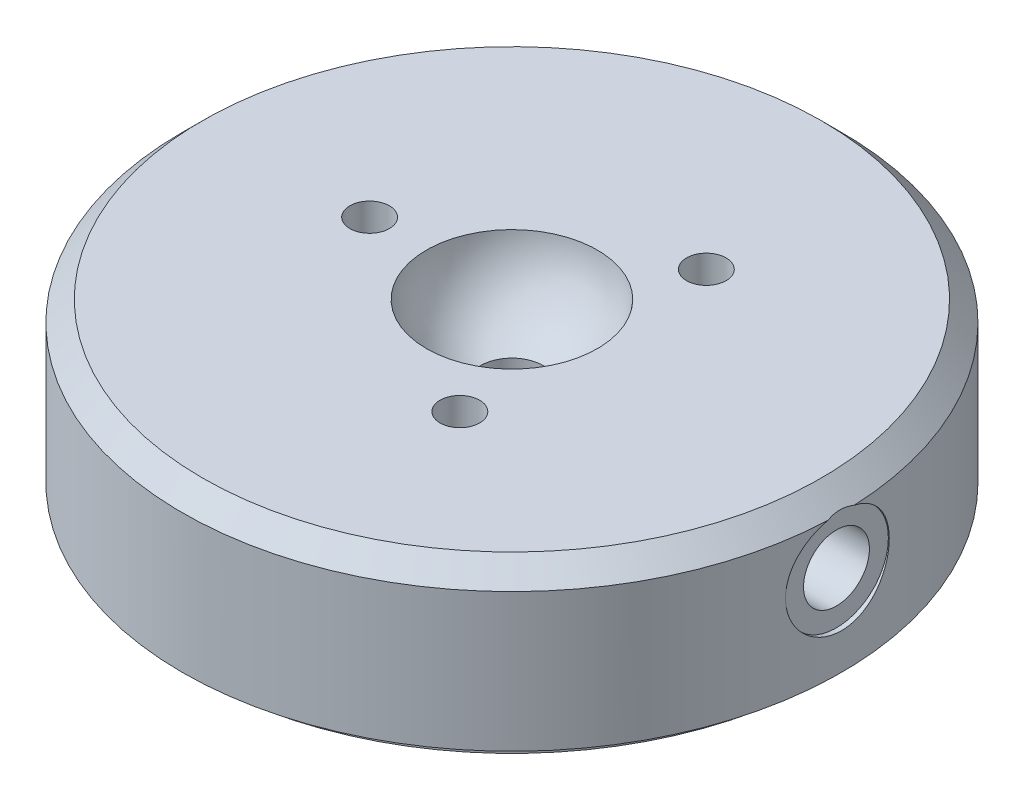
ISO-10303-21;
HEADER;
FILE_DESCRIPTION(('STEP AP214'),'2;1');
FILE_NAME('part.step','',(''),(''),'','','');
FILE_SCHEMA(('AUTOMOTIVE_DESIGN { 1 0 10303 214 1 1 1 1 }'));
ENDSEC;
DATA;
#1=APPLICATION_CONTEXT('core data for automotive mechanical design processes');
#2=APPLICATION_PROTOCOL_DEFINITION('international standard','automotive_design',2000,#1);
#3=PRODUCT_CONTEXT('',#1,'mechanical');
#4=PRODUCT('Part','Part','',(#3));
#5=PRODUCT_RELATED_PRODUCT_CATEGORY('part','',(#4));
#6=PRODUCT_DEFINITION_FORMATION('','',#4);
#7=PRODUCT_DEFINITION_CONTEXT('part definition',#1,'design');
#8=PRODUCT_DEFINITION('design','',#6,#7);
#9=PRODUCT_DEFINITION_SHAPE('','',#8);
#10=(LENGTH_UNIT() NAMED_UNIT(*) SI_UNIT(.MILLI.,.METRE.));
#11=(NAMED_UNIT(*) PLANE_ANGLE_UNIT() SI_UNIT($,.RADIAN.));
#12=(NAMED_UNIT(*) SI_UNIT($,.STERADIAN.) SOLID_ANGLE_UNIT());
#13=UNCERTAINTY_MEASURE_WITH_UNIT(LENGTH_MEASURE(1.E-05),#10,'distance_accuracy_value','');
#14=(GEOMETRIC_REPRESENTATION_CONTEXT(3) GLOBAL_UNCERTAINTY_ASSIGNED_CONTEXT((#13)) GLOBAL_UNIT_ASSIGNED_CONTEXT((#10,
#11,#12)) REPRESENTATION_CONTEXT('',''));
#15=CARTESIAN_POINT('',(0.,0.,0.));
#16=DIRECTION('',(0.,0.,1.));
#17=DIRECTION('',(1.,0.,0.));
#18=AXIS2_PLACEMENT_3D('',#15,#16,#17);
#19=CARTESIAN_POINT('',(0.,0.,0.));
#20=DIRECTION('',(0.,1.,0.));
#21=DIRECTION('',(0.,0.,1.));
#22=AXIS2_PLACEMENT_3D('',#19,#20,#21);
#23=PLANE('',#22);
#24=CARTESIAN_POINT('',(0.,0.,0.));
#25=DIRECTION('',(0.,1.,0.));
#26=DIRECTION('',(0.,0.,1.));
#27=AXIS2_PLACEMENT_3D('',#24,#25,#26);
#28=CIRCLE('',#27,25.);
#29=CARTESIAN_POINT('',(0.,0.,25.));
#30=VERTEX_POINT('',#29);
#31=EDGE_CURVE('E98',#30,#30,#28,.T.);
#32=ORIENTED_EDGE('',*,*,#31,.F.);
#33=EDGE_LOOP('',(#32));
#34=FACE_BOUND('',#33,.T.);
#35=CARTESIAN_POINT('',(0.,0.,0.));
#36=DIRECTION('',(0.,1.,0.));
#37=DIRECTION('',(0.,0.,1.));
#38=AXIS2_PLACEMENT_3D('',#35,#36,#37);
#39=CIRCLE('',#38,23.8062);
#40=CARTESIAN_POINT('',(0.,0.,23.8062));
#41=VERTEX_POINT('',#40);
#42=EDGE_CURVE('E61',#41,#41,#39,.F.);
#43=ORIENTED_EDGE('',*,*,#42,.F.);
#44=EDGE_LOOP('',(#43));
#45=FACE_BOUND('',#44,.T.);
#46=ADVANCED_FACE('F48',(#34,#45),#23,.F.);
#47=CARTESIAN_POINT('',(0.,12.0142,0.));
#48=DIRECTION('',(0.,-1.,0.));
#49=DIRECTION('',(0.,0.,-1.));
#50=AXIS2_PLACEMENT_3D('',#47,#48,#49);
#51=CYLINDRICAL_SURFACE('',#50,25.);
#52=CARTESIAN_POINT('',(0.,10.4902,0.));
#53=DIRECTION('',(0.,1.,0.));
#54=DIRECTION('',(0.,0.,1.));
#55=AXIS2_PLACEMENT_3D('',#52,#53,#54);
#56=CIRCLE('',#55,25.);
#57=CARTESIAN_POINT('',(24.9803148699131,10.4902,0.991901708840162));
#58=VERTEX_POINT('',#57);
#59=CARTESIAN_POINT('',(24.9803148699131,10.4902,-0.991901708840163));
#60=VERTEX_POINT('',#59);
#61=EDGE_CURVE('E86',#58,#60,#56,.F.);
#62=ORIENTED_EDGE('',*,*,#61,.T.);
#63=CARTESIAN_POINT('',(24.9803148699131,10.4902,-0.991901708840163));
#64=CARTESIAN_POINT('',(24.9760644121017,10.4623048694706,-1.09909263906591));
#65=CARTESIAN_POINT('',(24.9711596439136,10.4298739163801,-1.20506872251176));
#66=CARTESIAN_POINT('',(24.9602057760031,10.3562333686283,-1.41385230001184));
#67=CARTESIAN_POINT('',(24.9541568017236,10.3150247362288,-1.51666013997494));
#68=CARTESIAN_POINT('',(24.9410841497244,10.224159676023,-1.71829432237623));
#69=CARTESIAN_POINT('',(24.9340614229706,10.174511479727,-1.81712442941466));
#70=CARTESIAN_POINT('',(24.9192396242253,10.0671312351788,-2.0101950893509));
#71=CARTESIAN_POINT('',(24.9114405484112,10.009399147123,-2.10443561964742));
#72=CARTESIAN_POINT('',(24.8871967636647,9.82463062969311,-2.3793201898814));
#73=CARTESIAN_POINT('',(24.8698958404626,9.68595784311372,-2.55226903288885));
#74=CARTESIAN_POINT('',(24.8349644259187,9.38171910014679,-2.87238449379057));
#75=CARTESIAN_POINT('',(24.8173339539457,9.21615471989303,-3.01955262165919));
#76=CARTESIAN_POINT('',(24.7836125106737,8.86163506745147,-3.28489903018674));
#77=CARTESIAN_POINT('',(24.7675303397823,8.67255864957774,-3.40291695157319));
#78=CARTESIAN_POINT('',(24.7388545000623,8.2769938819654,-3.605496571226));
#79=CARTESIAN_POINT('',(24.7262610838239,8.07050427290122,-3.69005584723468));
#80=CARTESIAN_POINT('',(24.7060853872872,7.64717285774298,-3.82280792954634));
#81=CARTESIAN_POINT('',(24.698475589149,7.4303951106718,-3.87120064834859));
#82=CARTESIAN_POINT('',(24.6890460131689,6.99168557490381,-3.93089587270417));
#83=CARTESIAN_POINT('',(24.6872255081698,6.76975443701992,-3.94220303634909));
#84=CARTESIAN_POINT('',(24.6895735821576,6.32955241819738,-3.92746734125161));
#85=CARTESIAN_POINT('',(24.6936784051449,6.11126775975518,-3.90182209248306));
#86=CARTESIAN_POINT('',(24.7072887255053,5.68215127251021,-3.814682728154));
#87=CARTESIAN_POINT('',(24.716794367963,5.47131964408339,-3.75318764954117));
#88=CARTESIAN_POINT('',(24.7401360066554,5.06280397052349,-3.59610060480126));
#89=CARTESIAN_POINT('',(24.753976134313,4.86513268808484,-3.50047609594989));
#90=CARTESIAN_POINT('',(24.7844326557749,4.48854528250317,-3.27787581141221));
#91=CARTESIAN_POINT('',(24.8010492349438,4.30963041289519,-3.15089794220778));
#92=CARTESIAN_POINT('',(24.8354151853885,3.97351829245995,-2.8675238704803));
#93=CARTESIAN_POINT('',(24.8531750832332,3.81658414811986,-2.71081677269578));
#94=CARTESIAN_POINT('',(24.8876763015987,3.53114818508684,-2.37324690991153));
#95=CARTESIAN_POINT('',(24.9044175918141,3.40264721202763,-2.19238342673084));
#96=CARTESIAN_POINT('',(24.9350775441802,3.17725487143786,-1.81070597410455));
#97=CARTESIAN_POINT('',(24.9489845691253,3.08049286854182,-1.60981460336029));
#98=CARTESIAN_POINT('',(24.9723191119489,2.92216038382323,-1.1943677727902));
#99=CARTESIAN_POINT('',(24.9817469233442,2.8605875960449,-0.979813209340219));
#100=CARTESIAN_POINT('',(24.9949907062918,2.77490593618166,-0.545211430466069));
#101=CARTESIAN_POINT('',(24.9988569619274,2.75046126096289,-0.325231960355635));
#102=CARTESIAN_POINT('',(25.0007041424915,2.73872621275646,0.11573406862397));
#103=CARTESIAN_POINT('',(24.9986853762922,2.75143388984804,0.336720574031653));
#104=CARTESIAN_POINT('',(24.9890298596355,2.81335510775831,0.771579066882193));
#105=CARTESIAN_POINT('',(24.9814380309596,2.86227677131175,0.985493731347864));
#106=CARTESIAN_POINT('',(24.9615257732719,2.9948233185039,1.40205029090125));
#107=CARTESIAN_POINT('',(24.9492051815791,3.07844939606734,1.60469179789016));
#108=CARTESIAN_POINT('',(24.9211080130636,3.27852187470918,1.99417794500723));
#109=CARTESIAN_POINT('',(24.9053132782849,3.39514167340364,2.18093215784569));
#110=CARTESIAN_POINT('',(24.8720405347276,3.65773673705456,2.53235198365155));
#111=CARTESIAN_POINT('',(24.8545624044904,3.80371412101707,2.69701600073595));
#112=CARTESIAN_POINT('',(24.8196576709345,4.1227170095977,3.00139286443896));
#113=CARTESIAN_POINT('',(24.8022335602207,4.29601183151788,3.1408239028407));
#114=CARTESIAN_POINT('',(24.7695929059416,4.6637228605155,3.38864934140278));
#115=CARTESIAN_POINT('',(24.7543763528057,4.8581389760177,3.49704387612014));
#116=CARTESIAN_POINT('',(24.7278999953282,5.26257760548963,3.67960766646352));
#117=CARTESIAN_POINT('',(24.7166383011144,5.47259260707547,3.7537932745173));
#118=CARTESIAN_POINT('',(24.6993743084843,5.90231548178541,3.86576694062713));
#119=CARTESIAN_POINT('',(24.6933715957342,6.12202258987482,3.90355786609635));
#120=CARTESIAN_POINT('',(24.6873655534825,6.56229797704927,3.9413639640254));
#121=CARTESIAN_POINT('',(24.6872968177525,6.78283006332407,3.94179097444437));
#122=CARTESIAN_POINT('',(24.6930015917386,7.22080155281397,3.90589206503232));
#123=CARTESIAN_POINT('',(24.6987750116465,7.43824100351832,3.86956671017495));
#124=CARTESIAN_POINT('',(24.7154607258084,7.86292430484263,3.76150836552324));
#125=CARTESIAN_POINT('',(24.7263510250776,8.07020764047359,3.68992686187712));
#126=CARTESIAN_POINT('',(24.7520308367825,8.46983818355237,3.51352567382607));
#127=CARTESIAN_POINT('',(24.7668202464704,8.66218578440777,3.40870686526246));
#128=CARTESIAN_POINT('',(24.7987966108039,9.0283705778677,3.16773793796091));
#129=CARTESIAN_POINT('',(24.8160038716045,9.20202635713444,3.03131534729049));
#130=CARTESIAN_POINT('',(24.8508146379017,9.52426004834777,2.73124823369439));
#131=CARTESIAN_POINT('',(24.868418346291,9.67282477279947,2.56758948499511));
#132=CARTESIAN_POINT('',(24.8937152075362,9.87418284690543,2.30452838637883));
#133=CARTESIAN_POINT('',(24.9020018023323,9.9379882280999,2.21340574372853));
#134=CARTESIAN_POINT('',(24.9179431995995,10.057680869463,2.02606120620131));
#135=CARTESIAN_POINT('',(24.9255982430182,10.1135711552612,1.92984127924753));
#136=CARTESIAN_POINT('',(24.9400470316092,10.2169403600693,1.73313858266539));
#137=CARTESIAN_POINT('',(24.9468421684136,10.2644329203657,1.63266306120472));
#138=CARTESIAN_POINT('',(24.9593906463261,10.350755136961,1.42804376194001));
#139=CARTESIAN_POINT('',(24.9651446256143,10.3895901033647,1.32390227828425));
#140=CARTESIAN_POINT('',(24.9721219509041,10.4361268702976,1.18090322275723));
#141=CARTESIAN_POINT('',(24.9738717483264,10.4477400793774,1.14331091754036));
#142=CARTESIAN_POINT('',(24.9772128267798,10.4698238217765,1.06783127047912));
#143=CARTESIAN_POINT('',(24.9788042843043,10.4802956286319,1.02994430905506));
#144=CARTESIAN_POINT('',(24.9803148699131,10.4902,0.991901708840163));
#145=B_SPLINE_CURVE_WITH_KNOTS('',3,(#63,#64,#65,#66,#67,#68,#69,#70,#71,#72,#73,#74,#75,#76,
#77,#78,#79,#80,#81,#82,#83,#84,#85,#86,#87,#88,#89,#90,#91,#92,#93,#94,#95,#96,#97,#98,#99,
#100,#101,#102,#103,#104,#105,#106,#107,#108,#109,#110,#111,#112,#113,#114,#115,#116,#117,#118,
#119,#120,#121,#122,#123,#124,#125,#126,#127,#128,#129,#130,#131,#132,#133,#134,#135,#136,#137,
#138,#139,#140,#141,#142,#143,#144),.UNSPECIFIED.,.F.,.F.,(4,2,2,2,2,2,2,2,2,2,2,2,2,2,2,2,2,2,
2,2,2,2,2,2,2,2,2,2,2,2,2,2,2,2,2,2,2,2,2,2,4),(0.,0.332414110908146,0.664791799325737,
0.996847144702373,1.32890412511467,1.99255614185707,2.65616927555023,3.32335556075986,
3.99059013846687,4.65410869599637,5.31754390979323,5.97389360945856,6.63026094179411,
7.28725580577416,7.94429455030674,8.60862634351044,9.27297789201588,9.94000455805763,
10.606987508705,11.2679012752411,11.9287803547049,12.5843900975884,13.2400223970716,
13.8991664874663,14.558358171419,15.2245100286738,15.8906589978205,16.5564892059006,
17.2222669511924,17.880705329588,18.5391335863309,19.1947571155721,19.8503633698129,
20.5118473823875,21.1736779866784,21.5079962917394,21.8421864531041,22.175828665773,
22.509265673676,22.6274046365613,22.7454104049011),.UNSPECIFIED.);
#146=EDGE_CURVE('E66',#60,#58,#145,.T.);
#147=ORIENTED_EDGE('',*,*,#146,.T.);
#148=EDGE_LOOP('',(#62,#147));
#149=FACE_BOUND('',#148,.T.);
#150=ORIENTED_EDGE('',*,*,#31,.T.);
#151=EDGE_LOOP('',(#150));
#152=FACE_BOUND('',#151,.T.);
#153=ADVANCED_FACE('F83',(#149,#152),#51,.T.);
#154=CARTESIAN_POINT('',(0.,12.0142,0.));
#155=DIRECTION('',(0.,1.,0.));
#156=DIRECTION('',(0.,0.,1.));
#157=AXIS2_PLACEMENT_3D('',#154,#155,#156);
#158=PLANE('',#157);
#159=CARTESIAN_POINT('',(5.39749999999991,12.0142,9.34874423385306));
#160=DIRECTION('',(0.,1.,0.));
#161=DIRECTION('',(0.,0.,1.));
#162=AXIS2_PLACEMENT_3D('',#159,#160,#161);
#163=CIRCLE('',#162,1.5);
#164=CARTESIAN_POINT('',(5.39749999999991,12.0142,10.8487442338531));
#165=VERTEX_POINT('',#164);
#166=EDGE_CURVE('E265',#165,#165,#163,.T.);
#167=ORIENTED_EDGE('',*,*,#166,.F.);
#168=EDGE_LOOP('',(#167));
#169=FACE_BOUND('',#168,.T.);
#170=CARTESIAN_POINT('',(5.39750000000004,12.0142,-9.34874423385299));
#171=DIRECTION('',(0.,1.,0.));
#172=DIRECTION('',(0.,0.,1.));
#173=AXIS2_PLACEMENT_3D('',#170,#171,#172);
#174=CIRCLE('',#173,1.5);
#175=CARTESIAN_POINT('',(5.39750000000004,12.0142,-7.84874423385299));
#176=VERTEX_POINT('',#175);
#177=EDGE_CURVE('E253',#176,#176,#174,.T.);
#178=ORIENTED_EDGE('',*,*,#177,.F.);
#179=EDGE_LOOP('',(#178));
#180=FACE_BOUND('',#179,.T.);
#181=CARTESIAN_POINT('',(-10.795,12.0142,0.));
#182=DIRECTION('',(0.,1.,0.));
#183=DIRECTION('',(0.,0.,1.));
#184=AXIS2_PLACEMENT_3D('',#181,#182,#183);
#185=CIRCLE('',#184,1.5);
#186=CARTESIAN_POINT('',(-10.795,12.0142,1.5));
#187=VERTEX_POINT('',#186);
#188=EDGE_CURVE('E241',#187,#187,#185,.T.);
#189=ORIENTED_EDGE('',*,*,#188,.F.);
#190=EDGE_LOOP('',(#189));
#191=FACE_BOUND('',#190,.T.);
#192=CARTESIAN_POINT('',(0.,12.0142,0.));
#193=DIRECTION('',(0.,1.,0.));
#194=DIRECTION('',(0.,0.,1.));
#195=AXIS2_PLACEMENT_3D('',#192,#193,#194);
#196=CIRCLE('',#195,6.48252587808178);
#197=CARTESIAN_POINT('',(0.,12.0142,6.48252587808178));
#198=VERTEX_POINT('',#197);
#199=EDGE_CURVE('E102',#198,#198,#196,.T.);
#200=ORIENTED_EDGE('',*,*,#199,.F.);
#201=EDGE_LOOP('',(#200));
#202=FACE_BOUND('',#201,.T.);
#203=CARTESIAN_POINT('',(0.,12.0142,0.));
#204=DIRECTION('',(0.,1.,0.));
#205=DIRECTION('',(0.,0.,1.));
#206=AXIS2_PLACEMENT_3D('',#203,#204,#205);
#207=CIRCLE('',#206,23.476);
#208=CARTESIAN_POINT('',(0.,12.0142,23.476));
#209=VERTEX_POINT('',#208);
#210=EDGE_CURVE('E93',#209,#209,#207,.T.);
#211=ORIENTED_EDGE('',*,*,#210,.T.);
#212=EDGE_LOOP('',(#211));
#213=FACE_BOUND('',#212,.T.);
#214=ADVANCED_FACE('F213',(#169,#180,#191,#202,#213),#158,.T.);
#215=CARTESIAN_POINT('',(0.,12.0142,0.));
#216=DIRECTION('',(0.,-1.,0.));
#217=DIRECTION('',(0.,0.,-1.));
#218=AXIS2_PLACEMENT_3D('',#215,#216,#217);
#219=CONICAL_SURFACE('',#218,23.476,0.785398163397444);
#220=CARTESIAN_POINT('',(24.9912617892735,10.4773,-1.04019257351706));
#221=CARTESIAN_POINT('',(24.9720594670814,10.4999216717859,-0.957673295653899));
#222=CARTESIAN_POINT('',(24.9550859961547,10.5199599164967,-0.87391189493616));
#223=CARTESIAN_POINT('',(24.9257659228492,10.5546222020788,-0.704463924926277));
#224=CARTESIAN_POINT('',(24.9134202948386,10.5692451027699,-0.618776954236183));
#225=CARTESIAN_POINT('',(24.8938197103978,10.5924801009405,-0.448559412427655));
#226=CARTESIAN_POINT('',(24.8864283659726,10.6012532003374,-0.364066623537885));
#227=CARTESIAN_POINT('',(24.8762693044207,10.613315207545,-0.194426546820808));
#228=CARTESIAN_POINT('',(24.8735008887704,10.6166049438905,-0.109279359826524));
#229=CARTESIAN_POINT('',(24.8726032521123,10.6176713308341,0.0649686387439396));
#230=CARTESIAN_POINT('',(24.8746917628012,10.615189235687,0.154072349882698));
#231=CARTESIAN_POINT('',(24.8839338928822,10.6042143304783,0.331663122382244));
#232=CARTESIAN_POINT('',(24.8910887166382,10.5957200912099,0.420150032065106));
#233=CARTESIAN_POINT('',(24.9106668768206,10.5725069647133,0.598535207098015));
#234=CARTESIAN_POINT('',(24.9232467235405,10.5576032029229,0.688392136018941));
#235=CARTESIAN_POINT('',(24.953490648808,10.5218436782478,0.866018114178867));
#236=CARTESIAN_POINT('',(24.9711533156987,10.5009895679731,0.953787735810388));
#237=CARTESIAN_POINT('',(24.9912617892735,10.4773,1.04019257351706));
#238=B_SPLINE_CURVE_WITH_KNOTS('',3,(#220,#221,#222,#223,#224,#225,#226,#227,#228,#229,#230,
#231,#232,#233,#234,#235,#236,#237),.UNSPECIFIED.,.F.,.F.,(4,2,2,2,2,2,2,2,4),(0.,
0.263024143296641,0.526103633893643,0.78160543731945,1.0370686309806,1.30420329124433,
1.57140147608863,1.84688624853985,2.12229458404324),.UNSPECIFIED.);
#239=EDGE_CURVE('E13',#60,#58,#238,.T.);
#240=ORIENTED_EDGE('',*,*,#239,.F.);
#241=ORIENTED_EDGE('',*,*,#61,.F.);
#242=EDGE_LOOP('',(#240,#241));
#243=FACE_BOUND('',#242,.T.);
#244=ORIENTED_EDGE('',*,*,#210,.F.);
#245=EDGE_LOOP('',(#244));
#246=FACE_BOUND('',#245,.T.);
#247=ADVANCED_FACE('F50',(#243,#246),#219,.T.);
#248=CARTESIAN_POINT('',(0.,12.5222,0.));
#249=DIRECTION('',(0.,1.,0.));
#250=DIRECTION('',(1.,0.,0.));
#251=AXIS2_PLACEMENT_3D('',#248,#249,#250);
#252=SPHERICAL_SURFACE('',#251,6.5024);
#253=CARTESIAN_POINT('',(0.,6.47150960984616,0.));
#254=DIRECTION('',(0.,1.,0.));
#255=DIRECTION('',(0.,0.,1.));
#256=AXIS2_PLACEMENT_3D('',#253,#254,#255);
#257=CIRCLE('',#256,2.38124999999999);
#258=CARTESIAN_POINT('',(0.,6.47150960984616,2.38124999999999));
#259=VERTEX_POINT('',#258);
#260=EDGE_CURVE('E105',#259,#259,#257,.F.);
#261=ORIENTED_EDGE('',*,*,#260,.T.);
#262=EDGE_LOOP('',(#261));
#263=FACE_BOUND('',#262,.T.);
#264=ORIENTED_EDGE('',*,*,#199,.T.);
#265=EDGE_LOOP('',(#264));
#266=FACE_BOUND('',#265,.T.);
#267=ADVANCED_FACE('F205',(#263,#266),#252,.F.);
#268=CARTESIAN_POINT('',(0.,12.0142,0.));
#269=DIRECTION('',(0.,1.,0.));
#270=DIRECTION('',(0.,0.,1.));
#271=AXIS2_PLACEMENT_3D('',#268,#269,#270);
#272=CYLINDRICAL_SURFACE('',#271,2.38124999999999);
#273=CARTESIAN_POINT('',(0.,5.7658,0.));
#274=DIRECTION('',(0.,1.,0.));
#275=DIRECTION('',(0.,0.,1.));
#276=AXIS2_PLACEMENT_3D('',#273,#274,#275);
#277=CIRCLE('',#276,2.38125);
#278=CARTESIAN_POINT('',(0.,5.7658,2.38125));
#279=VERTEX_POINT('',#278);
#280=EDGE_CURVE('E107',#279,#279,#277,.T.);
#281=ORIENTED_EDGE('',*,*,#280,.F.);
#282=EDGE_LOOP('',(#281));
#283=FACE_BOUND('',#282,.T.);
#284=ORIENTED_EDGE('',*,*,#260,.F.);
#285=EDGE_LOOP('',(#284));
#286=FACE_BOUND('',#285,.T.);
#287=ADVANCED_FACE('F202',(#283,#286),#272,.F.);
#288=CARTESIAN_POINT('',(0.,5.7658,0.));
#289=DIRECTION('',(0.,-1.,0.));
#290=DIRECTION('',(0.,0.,-1.));
#291=AXIS2_PLACEMENT_3D('',#288,#289,#290);
#292=PLANE('',#291);
#293=ORIENTED_EDGE('',*,*,#280,.T.);
#294=EDGE_LOOP('',(#293));
#295=FACE_BOUND('',#294,.T.);
#296=ADVANCED_FACE('F200',(#295),#292,.F.);
#297=CARTESIAN_POINT('',(0.,-0.98552,0.));
#298=DIRECTION('',(0.,1.,0.));
#299=DIRECTION('',(0.,0.,1.));
#300=AXIS2_PLACEMENT_3D('',#297,#298,#299);
#301=CYLINDRICAL_SURFACE('',#300,23.8062);
#302=CARTESIAN_POINT('',(0.,-0.98552,0.));
#303=DIRECTION('',(0.,-1.,0.));
#304=DIRECTION('',(0.,0.,-1.));
#305=AXIS2_PLACEMENT_3D('',#302,#303,#304);
#306=CIRCLE('',#305,23.8062);
#307=CARTESIAN_POINT('',(0.,-0.98552,-23.8062));
#308=VERTEX_POINT('',#307);
#309=EDGE_CURVE('E229',#308,#308,#306,.T.);
#310=ORIENTED_EDGE('',*,*,#309,.F.);
#311=EDGE_LOOP('',(#310));
#312=FACE_BOUND('',#311,.T.);
#313=ORIENTED_EDGE('',*,*,#42,.T.);
#314=EDGE_LOOP('',(#313));
#315=FACE_BOUND('',#314,.T.);
#316=ADVANCED_FACE('F196',(#312,#315),#301,.T.);
#317=CARTESIAN_POINT('',(0.,-0.98552,0.));
#318=DIRECTION('',(0.,-1.,0.));
#319=DIRECTION('',(0.,0.,-1.));
#320=AXIS2_PLACEMENT_3D('',#317,#318,#319);
#321=PLANE('',#320);
#322=ORIENTED_EDGE('',*,*,#309,.T.);
#323=EDGE_LOOP('',(#322));
#324=FACE_BOUND('',#323,.T.);
#325=ADVANCED_FACE('F177',(#324),#321,.T.);
#326=CARTESIAN_POINT('',(-10.795,12.0142,0.));
#327=DIRECTION('',(0.,1.,0.));
#328=DIRECTION('',(0.,0.,1.));
#329=AXIS2_PLACEMENT_3D('',#326,#327,#328);
#330=CYLINDRICAL_SURFACE('',#329,1.5);
#331=CARTESIAN_POINT('',(-10.795,8.7122,0.));
#332=DIRECTION('',(0.,1.,0.));
#333=DIRECTION('',(0.,0.,1.));
#334=AXIS2_PLACEMENT_3D('',#331,#332,#333);
#335=CIRCLE('',#334,1.5);
#336=CARTESIAN_POINT('',(-10.795,8.7122,1.5));
#337=VERTEX_POINT('',#336);
#338=EDGE_CURVE('E244',#337,#337,#335,.T.);
#339=ORIENTED_EDGE('',*,*,#338,.F.);
#340=EDGE_LOOP('',(#339));
#341=FACE_BOUND('',#340,.T.);
#342=ORIENTED_EDGE('',*,*,#188,.T.);
#343=EDGE_LOOP('',(#342));
#344=FACE_BOUND('',#343,.T.);
#345=ADVANCED_FACE('F173',(#341,#344),#330,.F.);
#346=CARTESIAN_POINT('',(-9.545,8.7122,0.));
#347=DIRECTION('',(0.,-1.,0.));
#348=DIRECTION('',(0.,0.,-1.));
#349=AXIS2_PLACEMENT_3D('',#346,#347,#348);
#350=PLANE('',#349);
#351=CARTESIAN_POINT('',(-10.795,8.7122,0.));
#352=DIRECTION('',(0.,1.,0.));
#353=DIRECTION('',(0.,0.,1.));
#354=AXIS2_PLACEMENT_3D('',#351,#352,#353);
#355=CIRCLE('',#354,1.25);
#356=CARTESIAN_POINT('',(-10.795,8.7122,1.25));
#357=VERTEX_POINT('',#356);
#358=EDGE_CURVE('E247',#357,#357,#355,.T.);
#359=ORIENTED_EDGE('',*,*,#358,.F.);
#360=EDGE_LOOP('',(#359));
#361=FACE_BOUND('',#360,.T.);
#362=ORIENTED_EDGE('',*,*,#338,.T.);
#363=EDGE_LOOP('',(#362));
#364=FACE_BOUND('',#363,.T.);
#365=ADVANCED_FACE('F169',(#361,#364),#350,.F.);
#366=CARTESIAN_POINT('',(-10.795,12.0142,0.));
#367=DIRECTION('',(0.,1.,0.));
#368=DIRECTION('',(0.,0.,1.));
#369=AXIS2_PLACEMENT_3D('',#366,#367,#368);
#370=CYLINDRICAL_SURFACE('',#369,1.25);
#371=CARTESIAN_POINT('',(-10.795,7.212203,0.));
#372=DIRECTION('',(0.,1.,0.));
#373=DIRECTION('',(0.,0.,1.));
#374=AXIS2_PLACEMENT_3D('',#371,#372,#373);
#375=CIRCLE('',#374,1.25);
#376=CARTESIAN_POINT('',(-10.795,7.212203,1.25));
#377=VERTEX_POINT('',#376);
#378=EDGE_CURVE('E250',#377,#377,#375,.T.);
#379=ORIENTED_EDGE('',*,*,#378,.F.);
#380=EDGE_LOOP('',(#379));
#381=FACE_BOUND('',#380,.T.);
#382=ORIENTED_EDGE('',*,*,#358,.T.);
#383=EDGE_LOOP('',(#382));
#384=FACE_BOUND('',#383,.T.);
#385=ADVANCED_FACE('F165',(#381,#384),#370,.F.);
#386=CARTESIAN_POINT('',(-10.795,7.212203,0.));
#387=DIRECTION('',(0.,1.,0.));
#388=DIRECTION('',(0.,0.,1.));
#389=AXIS2_PLACEMENT_3D('',#386,#387,#388);
#390=CONICAL_SURFACE('',#389,1.25,1.02974425867665);
#391=CARTESIAN_POINT('',(-10.795,6.46112722621555,0.));
#392=VERTEX_POINT('',#391);
#393=VERTEX_LOOP('',#392);
#394=FACE_BOUND('',#393,.T.);
#395=ORIENTED_EDGE('',*,*,#378,.T.);
#396=EDGE_LOOP('',(#395));
#397=FACE_BOUND('',#396,.T.);
#398=ADVANCED_FACE('F161',(#394,#397),#390,.F.);
#399=CARTESIAN_POINT('',(5.39750000000004,12.0142,-9.34874423385299));
#400=DIRECTION('',(0.,1.,0.));
#401=DIRECTION('',(0.,0.,1.));
#402=AXIS2_PLACEMENT_3D('',#399,#400,#401);
#403=CYLINDRICAL_SURFACE('',#402,1.5);
#404=CARTESIAN_POINT('',(5.39750000000004,8.7122,-9.34874423385299));
#405=DIRECTION('',(0.,1.,0.));
#406=DIRECTION('',(0.,0.,1.));
#407=AXIS2_PLACEMENT_3D('',#404,#405,#406);
#408=CIRCLE('',#407,1.5);
#409=CARTESIAN_POINT('',(5.39750000000004,8.7122,-7.84874423385299));
#410=VERTEX_POINT('',#409);
#411=EDGE_CURVE('E256',#410,#410,#408,.T.);
#412=ORIENTED_EDGE('',*,*,#411,.F.);
#413=EDGE_LOOP('',(#412));
#414=FACE_BOUND('',#413,.T.);
#415=ORIENTED_EDGE('',*,*,#177,.T.);
#416=EDGE_LOOP('',(#415));
#417=FACE_BOUND('',#416,.T.);
#418=ADVANCED_FACE('F157',(#414,#417),#403,.F.);
#419=CARTESIAN_POINT('',(6.64750000000004,8.7122,-9.34874423385299));
#420=DIRECTION('',(0.,-1.,0.));
#421=DIRECTION('',(0.,0.,-1.));
#422=AXIS2_PLACEMENT_3D('',#419,#420,#421);
#423=PLANE('',#422);
#424=CARTESIAN_POINT('',(5.39750000000004,8.7122,-9.34874423385299));
#425=DIRECTION('',(0.,1.,0.));
#426=DIRECTION('',(0.,0.,1.));
#427=AXIS2_PLACEMENT_3D('',#424,#425,#426);
#428=CIRCLE('',#427,1.25);
#429=CARTESIAN_POINT('',(5.39750000000004,8.7122,-8.09874423385299));
#430=VERTEX_POINT('',#429);
#431=EDGE_CURVE('E259',#430,#430,#428,.T.);
#432=ORIENTED_EDGE('',*,*,#431,.F.);
#433=EDGE_LOOP('',(#432));
#434=FACE_BOUND('',#433,.T.);
#435=ORIENTED_EDGE('',*,*,#411,.T.);
#436=EDGE_LOOP('',(#435));
#437=FACE_BOUND('',#436,.T.);
#438=ADVANCED_FACE('F153',(#434,#437),#423,.F.);
#439=CARTESIAN_POINT('',(5.39750000000004,12.0142,-9.34874423385299));
#440=DIRECTION('',(0.,1.,0.));
#441=DIRECTION('',(0.,0.,1.));
#442=AXIS2_PLACEMENT_3D('',#439,#440,#441);
#443=CYLINDRICAL_SURFACE('',#442,1.25);
#444=CARTESIAN_POINT('',(5.39750000000004,7.212203,-9.34874423385299));
#445=DIRECTION('',(0.,1.,0.));
#446=DIRECTION('',(0.,0.,1.));
#447=AXIS2_PLACEMENT_3D('',#444,#445,#446);
#448=CIRCLE('',#447,1.25);
#449=CARTESIAN_POINT('',(5.39750000000004,7.212203,-8.09874423385299));
#450=VERTEX_POINT('',#449);
#451=EDGE_CURVE('E262',#450,#450,#448,.T.);
#452=ORIENTED_EDGE('',*,*,#451,.F.);
#453=EDGE_LOOP('',(#452));
#454=FACE_BOUND('',#453,.T.);
#455=ORIENTED_EDGE('',*,*,#431,.T.);
#456=EDGE_LOOP('',(#455));
#457=FACE_BOUND('',#456,.T.);
#458=ADVANCED_FACE('F149',(#454,#457),#443,.F.);
#459=CARTESIAN_POINT('',(5.39750000000004,7.212203,-9.34874423385299));
#460=DIRECTION('',(0.,1.,0.));
#461=DIRECTION('',(0.,0.,1.));
#462=AXIS2_PLACEMENT_3D('',#459,#460,#461);
#463=CONICAL_SURFACE('',#462,1.25,1.02974425867665);
#464=CARTESIAN_POINT('',(5.39750000000004,6.46112722621555,-9.34874423385299));
#465=VERTEX_POINT('',#464);
#466=VERTEX_LOOP('',#465);
#467=FACE_BOUND('',#466,.T.);
#468=ORIENTED_EDGE('',*,*,#451,.T.);
#469=EDGE_LOOP('',(#468));
#470=FACE_BOUND('',#469,.T.);
#471=ADVANCED_FACE('F145',(#467,#470),#463,.F.);
#472=CARTESIAN_POINT('',(5.39749999999991,12.0142,9.34874423385306));
#473=DIRECTION('',(0.,1.,0.));
#474=DIRECTION('',(0.,0.,1.));
#475=AXIS2_PLACEMENT_3D('',#472,#473,#474);
#476=CYLINDRICAL_SURFACE('',#475,1.5);
#477=CARTESIAN_POINT('',(5.39749999999991,8.7122,9.34874423385306));
#478=DIRECTION('',(0.,1.,0.));
#479=DIRECTION('',(0.,0.,1.));
#480=AXIS2_PLACEMENT_3D('',#477,#478,#479);
#481=CIRCLE('',#480,1.5);
#482=CARTESIAN_POINT('',(5.39749999999991,8.7122,10.8487442338531));
#483=VERTEX_POINT('',#482);
#484=EDGE_CURVE('E268',#483,#483,#481,.T.);
#485=ORIENTED_EDGE('',*,*,#484,.F.);
#486=EDGE_LOOP('',(#485));
#487=FACE_BOUND('',#486,.T.);
#488=ORIENTED_EDGE('',*,*,#166,.T.);
#489=EDGE_LOOP('',(#488));
#490=FACE_BOUND('',#489,.T.);
#491=ADVANCED_FACE('F141',(#487,#490),#476,.F.);
#492=CARTESIAN_POINT('',(6.64749999999991,8.7122,9.34874423385306));
#493=DIRECTION('',(0.,-1.,0.));
#494=DIRECTION('',(0.,0.,-1.));
#495=AXIS2_PLACEMENT_3D('',#492,#493,#494);
#496=PLANE('',#495);
#497=CARTESIAN_POINT('',(5.39749999999991,8.7122,9.34874423385306));
#498=DIRECTION('',(0.,1.,0.));
#499=DIRECTION('',(0.,0.,1.));
#500=AXIS2_PLACEMENT_3D('',#497,#498,#499);
#501=CIRCLE('',#500,1.25);
#502=CARTESIAN_POINT('',(5.39749999999991,8.7122,10.5987442338531));
#503=VERTEX_POINT('',#502);
#504=EDGE_CURVE('E270',#503,#503,#501,.T.);
#505=ORIENTED_EDGE('',*,*,#504,.F.);
#506=EDGE_LOOP('',(#505));
#507=FACE_BOUND('',#506,.T.);
#508=ORIENTED_EDGE('',*,*,#484,.T.);
#509=EDGE_LOOP('',(#508));
#510=FACE_BOUND('',#509,.T.);
#511=ADVANCED_FACE('F137',(#507,#510),#496,.F.);
#512=CARTESIAN_POINT('',(5.39749999999991,12.0142,9.34874423385306));
#513=DIRECTION('',(0.,1.,0.));
#514=DIRECTION('',(0.,0.,1.));
#515=AXIS2_PLACEMENT_3D('',#512,#513,#514);
#516=CYLINDRICAL_SURFACE('',#515,1.25);
#517=CARTESIAN_POINT('',(5.39749999999991,7.212203,9.34874423385306));
#518=DIRECTION('',(0.,1.,0.));
#519=DIRECTION('',(0.,0.,1.));
#520=AXIS2_PLACEMENT_3D('',#517,#518,#519);
#521=CIRCLE('',#520,1.25);
#522=CARTESIAN_POINT('',(5.39749999999991,7.212203,10.5987442338531));
#523=VERTEX_POINT('',#522);
#524=EDGE_CURVE('E87',#523,#523,#521,.T.);
#525=ORIENTED_EDGE('',*,*,#524,.F.);
#526=EDGE_LOOP('',(#525));
#527=FACE_BOUND('',#526,.T.);
#528=ORIENTED_EDGE('',*,*,#504,.T.);
#529=EDGE_LOOP('',(#528));
#530=FACE_BOUND('',#529,.T.);
#531=ADVANCED_FACE('F133',(#527,#530),#516,.F.);
#532=CARTESIAN_POINT('',(5.39749999999991,7.212203,9.34874423385306));
#533=DIRECTION('',(0.,1.,0.));
#534=DIRECTION('',(0.,0.,1.));
#535=AXIS2_PLACEMENT_3D('',#532,#533,#534);
#536=CONICAL_SURFACE('',#535,1.25,1.02974425867665);
#537=CARTESIAN_POINT('',(5.39749999999991,6.46112722621555,9.34874423385306));
#538=VERTEX_POINT('',#537);
#539=VERTEX_LOOP('',#538);
#540=FACE_BOUND('',#539,.T.);
#541=ORIENTED_EDGE('',*,*,#524,.T.);
#542=EDGE_LOOP('',(#541));
#543=FACE_BOUND('',#542,.T.);
#544=ADVANCED_FACE('F128',(#540,#543),#536,.F.);
#545=CARTESIAN_POINT('',(24.619,6.68019999999999,0.));
#546=DIRECTION('',(1.,0.,0.));
#547=DIRECTION('',(0.,0.,-1.));
#548=AXIS2_PLACEMENT_3D('',#545,#546,#547);
#549=CYLINDRICAL_SURFACE('',#548,3.937);
#550=CARTESIAN_POINT('',(24.619,6.68019999999999,0.));
#551=DIRECTION('',(1.,0.,0.));
#552=DIRECTION('',(0.,0.,-1.));
#553=AXIS2_PLACEMENT_3D('',#550,#551,#552);
#554=CIRCLE('',#553,3.937);
#555=CARTESIAN_POINT('',(24.619,6.68019999999999,-3.937));
#556=VERTEX_POINT('',#555);
#557=EDGE_CURVE('E109',#556,#556,#554,.T.);
#558=ORIENTED_EDGE('',*,*,#557,.F.);
#559=EDGE_LOOP('',(#558));
#560=FACE_BOUND('',#559,.T.);
#561=ORIENTED_EDGE('',*,*,#239,.T.);
#562=ORIENTED_EDGE('',*,*,#146,.F.);
#563=EDGE_LOOP('',(#561,#562));
#564=FACE_BOUND('',#563,.T.);
#565=ADVANCED_FACE('F90',(#560,#564),#549,.F.);
#566=CARTESIAN_POINT('',(24.619,6.68019999999999,0.));
#567=DIRECTION('',(1.,0.,0.));
#568=DIRECTION('',(0.,0.,-1.));
#569=AXIS2_PLACEMENT_3D('',#566,#567,#568);
#570=PLANE('',#569);
#571=ORIENTED_EDGE('',*,*,#557,.T.);
#572=EDGE_LOOP('',(#571));
#573=FACE_BOUND('',#572,.T.);
#574=CARTESIAN_POINT('',(24.619,6.6802,0.));
#575=DIRECTION('',(1.,0.,0.));
#576=DIRECTION('',(0.,0.,-1.));
#577=AXIS2_PLACEMENT_3D('',#574,#575,#576);
#578=CIRCLE('',#577,2.5);
#579=CARTESIAN_POINT('',(24.619,6.6802,-2.5));
#580=VERTEX_POINT('',#579);
#581=EDGE_CURVE('E88',#580,#580,#578,.F.);
#582=ORIENTED_EDGE('',*,*,#581,.T.);
#583=EDGE_LOOP('',(#582));
#584=FACE_BOUND('',#583,.T.);
#585=ADVANCED_FACE('F127',(#573,#584),#570,.T.);
#586=CARTESIAN_POINT('',(6.458,6.6802,0.));
#587=DIRECTION('',(1.,0.,0.));
#588=DIRECTION('',(0.,0.,-1.));
#589=AXIS2_PLACEMENT_3D('',#586,#587,#588);
#590=CONICAL_SURFACE('',#589,2.1,1.02974425867665);
#591=CARTESIAN_POINT('',(5.19619270004212,6.68019999999999,0.));
#592=VERTEX_POINT('',#591);
#593=VERTEX_LOOP('',#592);
#594=FACE_BOUND('',#593,.T.);
#595=CARTESIAN_POINT('',(6.458,6.6802,0.));
#596=DIRECTION('',(1.,0.,0.));
#597=DIRECTION('',(0.,0.,-1.));
#598=AXIS2_PLACEMENT_3D('',#595,#596,#597);
#599=CIRCLE('',#598,2.1);
#600=CARTESIAN_POINT('',(6.458,6.6802,-2.09999999999999));
#601=VERTEX_POINT('',#600);
#602=EDGE_CURVE('E238',#601,#601,#599,.T.);
#603=ORIENTED_EDGE('',*,*,#602,.T.);
#604=EDGE_LOOP('',(#603));
#605=FACE_BOUND('',#604,.T.);
#606=ADVANCED_FACE('F179',(#594,#605),#590,.F.);
#607=CARTESIAN_POINT('',(25.,6.6802,0.));
#608=DIRECTION('',(1.,0.,0.));
#609=DIRECTION('',(0.,0.,-1.));
#610=AXIS2_PLACEMENT_3D('',#607,#608,#609);
#611=CYLINDRICAL_SURFACE('',#610,2.1);
#612=ORIENTED_EDGE('',*,*,#602,.F.);
#613=EDGE_LOOP('',(#612));
#614=FACE_BOUND('',#613,.T.);
#615=CARTESIAN_POINT('',(17.38,6.6802,0.));
#616=DIRECTION('',(1.,0.,0.));
#617=DIRECTION('',(0.,0.,-1.));
#618=AXIS2_PLACEMENT_3D('',#615,#616,#617);
#619=CIRCLE('',#618,2.1);
#620=CARTESIAN_POINT('',(17.38,6.6802,-2.1));
#621=VERTEX_POINT('',#620);
#622=EDGE_CURVE('E235',#621,#621,#619,.T.);
#623=ORIENTED_EDGE('',*,*,#622,.T.);
#624=EDGE_LOOP('',(#623));
#625=FACE_BOUND('',#624,.T.);
#626=ADVANCED_FACE('F182',(#614,#625),#611,.F.);
#627=CARTESIAN_POINT('',(17.38,8.7802,0.));
#628=DIRECTION('',(-1.,0.,0.));
#629=DIRECTION('',(0.,0.,1.));
#630=AXIS2_PLACEMENT_3D('',#627,#628,#629);
#631=PLANE('',#630);
#632=ORIENTED_EDGE('',*,*,#622,.F.);
#633=EDGE_LOOP('',(#632));
#634=FACE_BOUND('',#633,.T.);
#635=CARTESIAN_POINT('',(17.38,6.6802,0.));
#636=DIRECTION('',(1.,0.,0.));
#637=DIRECTION('',(0.,0.,-1.));
#638=AXIS2_PLACEMENT_3D('',#635,#636,#637);
#639=CIRCLE('',#638,2.5);
#640=CARTESIAN_POINT('',(17.38,6.6802,-2.5));
#641=VERTEX_POINT('',#640);
#642=EDGE_CURVE('E232',#641,#641,#639,.T.);
#643=ORIENTED_EDGE('',*,*,#642,.T.);
#644=EDGE_LOOP('',(#643));
#645=FACE_BOUND('',#644,.T.);
#646=ADVANCED_FACE('F185',(#634,#645),#631,.F.);
#647=CARTESIAN_POINT('',(25.,6.6802,0.));
#648=DIRECTION('',(1.,0.,0.));
#649=DIRECTION('',(0.,0.,-1.));
#650=AXIS2_PLACEMENT_3D('',#647,#648,#649);
#651=CYLINDRICAL_SURFACE('',#650,2.5);
#652=ORIENTED_EDGE('',*,*,#642,.F.);
#653=EDGE_LOOP('',(#652));
#654=FACE_BOUND('',#653,.T.);
#655=ORIENTED_EDGE('',*,*,#581,.F.);
#656=EDGE_LOOP('',(#655));
#657=FACE_BOUND('',#656,.T.);
#658=ADVANCED_FACE('F189',(#654,#657),#651,.F.);
#659=CLOSED_SHELL('',(#46,#153,#214,#247,#267,#287,#296,#316,#325,#345,#365,#385,#398,#418,#438,
#458,#471,#491,#511,#531,#544,#565,#585,#606,#626,#646,#658));
#660=MANIFOLD_SOLID_BREP('B2',#659);
#661=ADVANCED_BREP_SHAPE_REPRESENTATION('',(#18,#660),#14);
#662=SHAPE_DEFINITION_REPRESENTATION(#9,#661);
ENDSEC;
END-ISO-10303-21;
